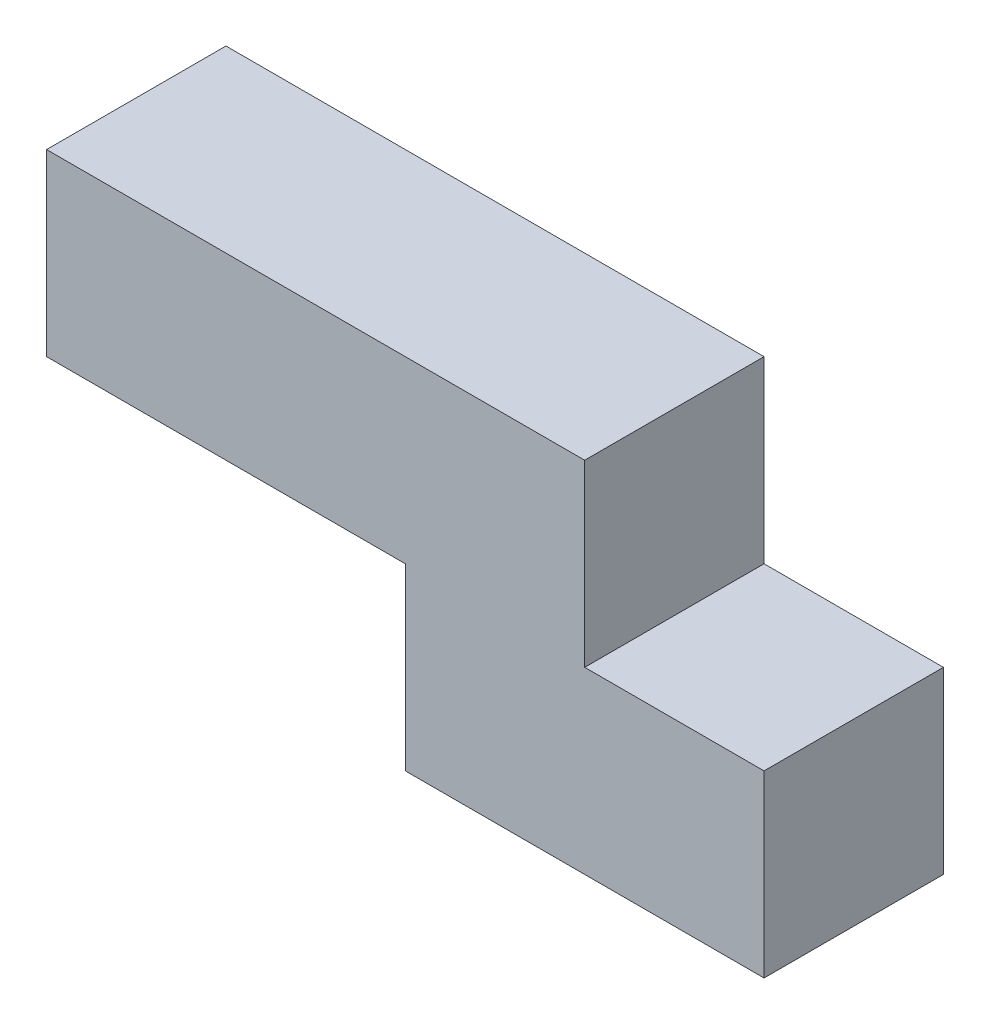
ISO-10303-21;
HEADER;
FILE_DESCRIPTION(('STEP AP214'),'2;1');
FILE_NAME('part.step','',(''),(''),'','','');
FILE_SCHEMA(('AUTOMOTIVE_DESIGN { 1 0 10303 214 1 1 1 1 }'));
ENDSEC;
DATA;
#1=APPLICATION_CONTEXT('core data for automotive mechanical design processes');
#2=APPLICATION_PROTOCOL_DEFINITION('international standard','automotive_design',2000,#1);
#3=PRODUCT_CONTEXT('',#1,'mechanical');
#4=PRODUCT('Part','Part','',(#3));
#5=PRODUCT_RELATED_PRODUCT_CATEGORY('part','',(#4));
#6=PRODUCT_DEFINITION_FORMATION('','',#4);
#7=PRODUCT_DEFINITION_CONTEXT('part definition',#1,'design');
#8=PRODUCT_DEFINITION('design','',#6,#7);
#9=PRODUCT_DEFINITION_SHAPE('','',#8);
#10=(LENGTH_UNIT() NAMED_UNIT(*) SI_UNIT(.MILLI.,.METRE.));
#11=(NAMED_UNIT(*) PLANE_ANGLE_UNIT() SI_UNIT($,.RADIAN.));
#12=(NAMED_UNIT(*) SI_UNIT($,.STERADIAN.) SOLID_ANGLE_UNIT());
#13=UNCERTAINTY_MEASURE_WITH_UNIT(LENGTH_MEASURE(1.E-05),#10,'distance_accuracy_value','');
#14=(GEOMETRIC_REPRESENTATION_CONTEXT(3) GLOBAL_UNCERTAINTY_ASSIGNED_CONTEXT((#13)) GLOBAL_UNIT_ASSIGNED_CONTEXT((#10,
#11,#12)) REPRESENTATION_CONTEXT('',''));
#15=CARTESIAN_POINT('',(0.,0.,0.));
#16=DIRECTION('',(0.,0.,1.));
#17=DIRECTION('',(1.,0.,0.));
#18=AXIS2_PLACEMENT_3D('',#15,#16,#17);
#19=CARTESIAN_POINT('',(50.8,0.,25.4));
#20=DIRECTION('',(0.,1.,0.));
#21=DIRECTION('',(0.,0.,1.));
#22=AXIS2_PLACEMENT_3D('',#19,#20,#21);
#23=PLANE('',#22);
#24=DIRECTION('',(1.,0.,0.));
#25=VECTOR('',#24,1.);
#26=CARTESIAN_POINT('',(50.8,0.,0.));
#27=LINE('',#26,#25);
#28=CARTESIAN_POINT('',(50.8,0.,0.));
#29=VERTEX_POINT('',#28);
#30=CARTESIAN_POINT('',(101.6,0.,0.));
#31=VERTEX_POINT('',#30);
#32=EDGE_CURVE('E129',#29,#31,#27,.T.);
#33=ORIENTED_EDGE('',*,*,#32,.T.);
#34=DIRECTION('',(0.,0.,-1.));
#35=VECTOR('',#34,1.);
#36=CARTESIAN_POINT('',(101.6,0.,25.4));
#37=LINE('',#36,#35);
#38=CARTESIAN_POINT('',(101.6,0.,25.4));
#39=VERTEX_POINT('',#38);
#40=EDGE_CURVE('E11',#39,#31,#37,.T.);
#41=ORIENTED_EDGE('',*,*,#40,.F.);
#42=DIRECTION('',(1.,0.,0.));
#43=VECTOR('',#42,1.);
#44=CARTESIAN_POINT('',(50.8,0.,25.4));
#45=LINE('',#44,#43);
#46=CARTESIAN_POINT('',(50.8,0.,25.4));
#47=VERTEX_POINT('',#46);
#48=EDGE_CURVE('E143',#47,#39,#45,.T.);
#49=ORIENTED_EDGE('',*,*,#48,.F.);
#50=DIRECTION('',(0.,0.,-1.));
#51=VECTOR('',#50,1.);
#52=CARTESIAN_POINT('',(50.8,0.,25.4));
#53=LINE('',#52,#51);
#54=EDGE_CURVE('E125',#47,#29,#53,.T.);
#55=ORIENTED_EDGE('',*,*,#54,.T.);
#56=EDGE_LOOP('',(#33,#41,#49,#55));
#57=FACE_BOUND('',#56,.T.);
#58=ADVANCED_FACE('F33',(#57),#23,.F.);
#59=CARTESIAN_POINT('',(101.6,0.,25.4));
#60=DIRECTION('',(-1.,0.,0.));
#61=DIRECTION('',(0.,0.,1.));
#62=AXIS2_PLACEMENT_3D('',#59,#60,#61);
#63=PLANE('',#62);
#64=DIRECTION('',(0.,1.,0.));
#65=VECTOR('',#64,1.);
#66=CARTESIAN_POINT('',(101.6,0.,0.));
#67=LINE('',#66,#65);
#68=CARTESIAN_POINT('',(101.6,25.4,0.));
#69=VERTEX_POINT('',#68);
#70=EDGE_CURVE('E132',#31,#69,#67,.T.);
#71=ORIENTED_EDGE('',*,*,#70,.T.);
#72=DIRECTION('',(0.,0.,-1.));
#73=VECTOR('',#72,1.);
#74=CARTESIAN_POINT('',(101.6,25.4,25.4));
#75=LINE('',#74,#73);
#76=CARTESIAN_POINT('',(101.6,25.4,25.4));
#77=VERTEX_POINT('',#76);
#78=EDGE_CURVE('E41',#77,#69,#75,.T.);
#79=ORIENTED_EDGE('',*,*,#78,.F.);
#80=DIRECTION('',(0.,1.,0.));
#81=VECTOR('',#80,1.);
#82=CARTESIAN_POINT('',(101.6,0.,25.4));
#83=LINE('',#82,#81);
#84=EDGE_CURVE('E92',#39,#77,#83,.T.);
#85=ORIENTED_EDGE('',*,*,#84,.F.);
#86=ORIENTED_EDGE('',*,*,#40,.T.);
#87=EDGE_LOOP('',(#71,#79,#85,#86));
#88=FACE_BOUND('',#87,.T.);
#89=ADVANCED_FACE('F178',(#88),#63,.F.);
#90=CARTESIAN_POINT('',(101.6,25.4,25.4));
#91=DIRECTION('',(0.,-1.,0.));
#92=DIRECTION('',(0.,0.,-1.));
#93=AXIS2_PLACEMENT_3D('',#90,#91,#92);
#94=PLANE('',#93);
#95=DIRECTION('',(-1.,0.,0.));
#96=VECTOR('',#95,1.);
#97=CARTESIAN_POINT('',(101.6,25.4,0.));
#98=LINE('',#97,#96);
#99=CARTESIAN_POINT('',(76.2,25.4,0.));
#100=VERTEX_POINT('',#99);
#101=EDGE_CURVE('E134',#69,#100,#98,.T.);
#102=ORIENTED_EDGE('',*,*,#101,.T.);
#103=DIRECTION('',(0.,0.,-1.));
#104=VECTOR('',#103,1.);
#105=CARTESIAN_POINT('',(76.2,25.4,25.4));
#106=LINE('',#105,#104);
#107=CARTESIAN_POINT('',(76.2,25.4,25.4));
#108=VERTEX_POINT('',#107);
#109=EDGE_CURVE('E150',#108,#100,#106,.T.);
#110=ORIENTED_EDGE('',*,*,#109,.F.);
#111=DIRECTION('',(-1.,0.,0.));
#112=VECTOR('',#111,1.);
#113=CARTESIAN_POINT('',(101.6,25.4,25.4));
#114=LINE('',#113,#112);
#115=EDGE_CURVE('E158',#77,#108,#114,.T.);
#116=ORIENTED_EDGE('',*,*,#115,.F.);
#117=ORIENTED_EDGE('',*,*,#78,.T.);
#118=EDGE_LOOP('',(#102,#110,#116,#117));
#119=FACE_BOUND('',#118,.T.);
#120=ADVANCED_FACE('F156',(#119),#94,.F.);
#121=CARTESIAN_POINT('',(76.2,25.4,25.4));
#122=DIRECTION('',(-1.,0.,0.));
#123=DIRECTION('',(0.,0.,1.));
#124=AXIS2_PLACEMENT_3D('',#121,#122,#123);
#125=PLANE('',#124);
#126=DIRECTION('',(0.,1.,0.));
#127=VECTOR('',#126,1.);
#128=CARTESIAN_POINT('',(76.2,25.4,0.));
#129=LINE('',#128,#127);
#130=CARTESIAN_POINT('',(76.2,50.8,0.));
#131=VERTEX_POINT('',#130);
#132=EDGE_CURVE('E136',#100,#131,#129,.T.);
#133=ORIENTED_EDGE('',*,*,#132,.T.);
#134=DIRECTION('',(0.,0.,-1.));
#135=VECTOR('',#134,1.);
#136=CARTESIAN_POINT('',(76.2,50.8,25.4));
#137=LINE('',#136,#135);
#138=CARTESIAN_POINT('',(76.2,50.8,25.4));
#139=VERTEX_POINT('',#138);
#140=EDGE_CURVE('E147',#139,#131,#137,.T.);
#141=ORIENTED_EDGE('',*,*,#140,.F.);
#142=DIRECTION('',(0.,1.,0.));
#143=VECTOR('',#142,1.);
#144=CARTESIAN_POINT('',(76.2,25.4,25.4));
#145=LINE('',#144,#143);
#146=EDGE_CURVE('E170',#108,#139,#145,.T.);
#147=ORIENTED_EDGE('',*,*,#146,.F.);
#148=ORIENTED_EDGE('',*,*,#109,.T.);
#149=EDGE_LOOP('',(#133,#141,#147,#148));
#150=FACE_BOUND('',#149,.T.);
#151=ADVANCED_FACE('F166',(#150),#125,.F.);
#152=CARTESIAN_POINT('',(76.2,50.8,25.4));
#153=DIRECTION('',(0.,-1.,0.));
#154=DIRECTION('',(0.,0.,-1.));
#155=AXIS2_PLACEMENT_3D('',#152,#153,#154);
#156=PLANE('',#155);
#157=DIRECTION('',(-1.,0.,0.));
#158=VECTOR('',#157,1.);
#159=CARTESIAN_POINT('',(76.2,50.8,0.));
#160=LINE('',#159,#158);
#161=CARTESIAN_POINT('',(0.,50.8,0.));
#162=VERTEX_POINT('',#161);
#163=EDGE_CURVE('E138',#131,#162,#160,.T.);
#164=ORIENTED_EDGE('',*,*,#163,.T.);
#165=DIRECTION('',(0.,0.,-1.));
#166=VECTOR('',#165,1.);
#167=CARTESIAN_POINT('',(0.,50.8,25.4));
#168=LINE('',#167,#166);
#169=CARTESIAN_POINT('',(0.,50.8,25.4));
#170=VERTEX_POINT('',#169);
#171=EDGE_CURVE('E120',#170,#162,#168,.T.);
#172=ORIENTED_EDGE('',*,*,#171,.F.);
#173=DIRECTION('',(-1.,0.,0.));
#174=VECTOR('',#173,1.);
#175=CARTESIAN_POINT('',(76.2,50.8,25.4));
#176=LINE('',#175,#174);
#177=EDGE_CURVE('E111',#139,#170,#176,.T.);
#178=ORIENTED_EDGE('',*,*,#177,.F.);
#179=ORIENTED_EDGE('',*,*,#140,.T.);
#180=EDGE_LOOP('',(#164,#172,#178,#179));
#181=FACE_BOUND('',#180,.T.);
#182=ADVANCED_FACE('F169',(#181),#156,.F.);
#183=CARTESIAN_POINT('',(0.,50.8,25.4));
#184=DIRECTION('',(1.,0.,0.));
#185=DIRECTION('',(0.,0.,-1.));
#186=AXIS2_PLACEMENT_3D('',#183,#184,#185);
#187=PLANE('',#186);
#188=DIRECTION('',(0.,-1.,0.));
#189=VECTOR('',#188,1.);
#190=CARTESIAN_POINT('',(0.,50.8,0.));
#191=LINE('',#190,#189);
#192=CARTESIAN_POINT('',(0.,25.4,0.));
#193=VERTEX_POINT('',#192);
#194=EDGE_CURVE('E119',#162,#193,#191,.T.);
#195=ORIENTED_EDGE('',*,*,#194,.T.);
#196=DIRECTION('',(0.,0.,-1.));
#197=VECTOR('',#196,1.);
#198=CARTESIAN_POINT('',(0.,25.4,25.4));
#199=LINE('',#198,#197);
#200=CARTESIAN_POINT('',(0.,25.4,25.4));
#201=VERTEX_POINT('',#200);
#202=EDGE_CURVE('E116',#201,#193,#199,.T.);
#203=ORIENTED_EDGE('',*,*,#202,.F.);
#204=DIRECTION('',(0.,-1.,0.));
#205=VECTOR('',#204,1.);
#206=CARTESIAN_POINT('',(0.,50.8,25.4));
#207=LINE('',#206,#205);
#208=EDGE_CURVE('E105',#170,#201,#207,.T.);
#209=ORIENTED_EDGE('',*,*,#208,.F.);
#210=ORIENTED_EDGE('',*,*,#171,.T.);
#211=EDGE_LOOP('',(#195,#203,#209,#210));
#212=FACE_BOUND('',#211,.T.);
#213=ADVANCED_FACE('F117',(#212),#187,.F.);
#214=CARTESIAN_POINT('',(0.,25.4,25.4));
#215=DIRECTION('',(0.,1.,0.));
#216=DIRECTION('',(0.,0.,1.));
#217=AXIS2_PLACEMENT_3D('',#214,#215,#216);
#218=PLANE('',#217);
#219=DIRECTION('',(1.,0.,0.));
#220=VECTOR('',#219,1.);
#221=CARTESIAN_POINT('',(0.,25.4,0.));
#222=LINE('',#221,#220);
#223=CARTESIAN_POINT('',(50.8,25.4,0.));
#224=VERTEX_POINT('',#223);
#225=EDGE_CURVE('E78',#193,#224,#222,.T.);
#226=ORIENTED_EDGE('',*,*,#225,.T.);
#227=DIRECTION('',(0.,0.,-1.));
#228=VECTOR('',#227,1.);
#229=CARTESIAN_POINT('',(50.8,25.4,25.4));
#230=LINE('',#229,#228);
#231=CARTESIAN_POINT('',(50.8,25.4,25.4));
#232=VERTEX_POINT('',#231);
#233=EDGE_CURVE('E121',#232,#224,#230,.T.);
#234=ORIENTED_EDGE('',*,*,#233,.F.);
#235=DIRECTION('',(1.,0.,0.));
#236=VECTOR('',#235,1.);
#237=CARTESIAN_POINT('',(0.,25.4,25.4));
#238=LINE('',#237,#236);
#239=EDGE_CURVE('E109',#201,#232,#238,.T.);
#240=ORIENTED_EDGE('',*,*,#239,.F.);
#241=ORIENTED_EDGE('',*,*,#202,.T.);
#242=EDGE_LOOP('',(#226,#234,#240,#241));
#243=FACE_BOUND('',#242,.T.);
#244=ADVANCED_FACE('F123',(#243),#218,.F.);
#245=CARTESIAN_POINT('',(50.8,25.4,25.4));
#246=DIRECTION('',(1.,0.,0.));
#247=DIRECTION('',(0.,0.,-1.));
#248=AXIS2_PLACEMENT_3D('',#245,#246,#247);
#249=PLANE('',#248);
#250=DIRECTION('',(0.,-1.,0.));
#251=VECTOR('',#250,1.);
#252=CARTESIAN_POINT('',(50.8,25.4,0.));
#253=LINE('',#252,#251);
#254=EDGE_CURVE('E84',#224,#29,#253,.T.);
#255=ORIENTED_EDGE('',*,*,#254,.T.);
#256=ORIENTED_EDGE('',*,*,#54,.F.);
#257=DIRECTION('',(0.,-1.,0.));
#258=VECTOR('',#257,1.);
#259=CARTESIAN_POINT('',(50.8,25.4,25.4));
#260=LINE('',#259,#258);
#261=EDGE_CURVE('E49',#232,#47,#260,.T.);
#262=ORIENTED_EDGE('',*,*,#261,.F.);
#263=ORIENTED_EDGE('',*,*,#233,.T.);
#264=EDGE_LOOP('',(#255,#256,#262,#263));
#265=FACE_BOUND('',#264,.T.);
#266=ADVANCED_FACE('F194',(#265),#249,.F.);
#267=CARTESIAN_POINT('',(0.,0.,25.4));
#268=DIRECTION('',(0.,0.,1.));
#269=DIRECTION('',(1.,0.,0.));
#270=AXIS2_PLACEMENT_3D('',#267,#268,#269);
#271=PLANE('',#270);
#272=ORIENTED_EDGE('',*,*,#48,.T.);
#273=ORIENTED_EDGE('',*,*,#84,.T.);
#274=ORIENTED_EDGE('',*,*,#115,.T.);
#275=ORIENTED_EDGE('',*,*,#146,.T.);
#276=ORIENTED_EDGE('',*,*,#177,.T.);
#277=ORIENTED_EDGE('',*,*,#208,.T.);
#278=ORIENTED_EDGE('',*,*,#239,.T.);
#279=ORIENTED_EDGE('',*,*,#261,.T.);
#280=EDGE_LOOP('',(#272,#273,#274,#275,#276,#277,#278,#279));
#281=FACE_BOUND('',#280,.T.);
#282=ADVANCED_FACE('F107',(#281),#271,.T.);
#283=CARTESIAN_POINT('',(0.,0.,0.));
#284=DIRECTION('',(0.,0.,1.));
#285=DIRECTION('',(1.,0.,0.));
#286=AXIS2_PLACEMENT_3D('',#283,#284,#285);
#287=PLANE('',#286);
#288=ORIENTED_EDGE('',*,*,#32,.F.);
#289=ORIENTED_EDGE('',*,*,#254,.F.);
#290=ORIENTED_EDGE('',*,*,#225,.F.);
#291=ORIENTED_EDGE('',*,*,#194,.F.);
#292=ORIENTED_EDGE('',*,*,#163,.F.);
#293=ORIENTED_EDGE('',*,*,#132,.F.);
#294=ORIENTED_EDGE('',*,*,#101,.F.);
#295=ORIENTED_EDGE('',*,*,#70,.F.);
#296=EDGE_LOOP('',(#288,#289,#290,#291,#292,#293,#294,#295));
#297=FACE_BOUND('',#296,.T.);
#298=ADVANCED_FACE('F162',(#297),#287,.F.);
#299=CLOSED_SHELL('',(#58,#89,#120,#151,#182,#213,#244,#266,#282,#298));
#300=MANIFOLD_SOLID_BREP('B2',#299);
#301=ADVANCED_BREP_SHAPE_REPRESENTATION('',(#18,#300),#14);
#302=SHAPE_DEFINITION_REPRESENTATION(#9,#301);
ENDSEC;
END-ISO-10303-21;
